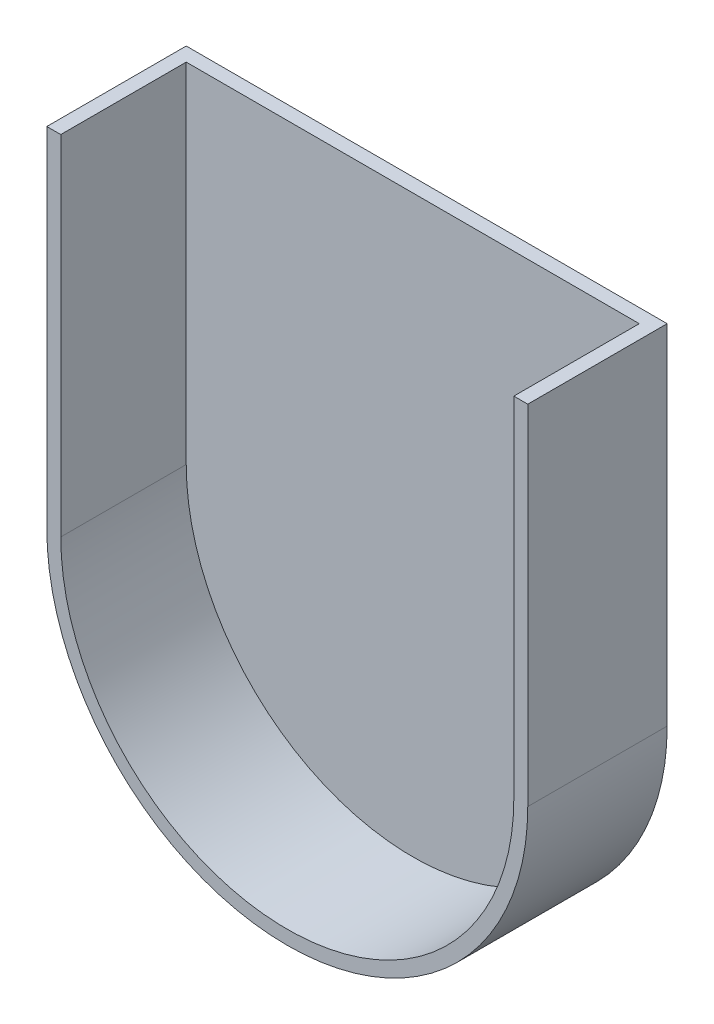
ISO-10303-21;
HEADER;
FILE_DESCRIPTION(('STEP AP214'),'2;1');
FILE_NAME('part.step','',(''),(''),'','','');
FILE_SCHEMA(('AUTOMOTIVE_DESIGN { 1 0 10303 214 1 1 1 1 }'));
ENDSEC;
DATA;
#1=APPLICATION_CONTEXT('core data for automotive mechanical design processes');
#2=APPLICATION_PROTOCOL_DEFINITION('international standard','automotive_design',2000,#1);
#3=PRODUCT_CONTEXT('',#1,'mechanical');
#4=PRODUCT('Part','Part','',(#3));
#5=PRODUCT_RELATED_PRODUCT_CATEGORY('part','',(#4));
#6=PRODUCT_DEFINITION_FORMATION('','',#4);
#7=PRODUCT_DEFINITION_CONTEXT('part definition',#1,'design');
#8=PRODUCT_DEFINITION('design','',#6,#7);
#9=PRODUCT_DEFINITION_SHAPE('','',#8);
#10=(LENGTH_UNIT() NAMED_UNIT(*) SI_UNIT(.MILLI.,.METRE.));
#11=(NAMED_UNIT(*) PLANE_ANGLE_UNIT() SI_UNIT($,.RADIAN.));
#12=(NAMED_UNIT(*) SI_UNIT($,.STERADIAN.) SOLID_ANGLE_UNIT());
#13=UNCERTAINTY_MEASURE_WITH_UNIT(LENGTH_MEASURE(1.E-05),#10,'distance_accuracy_value','');
#14=(GEOMETRIC_REPRESENTATION_CONTEXT(3) GLOBAL_UNCERTAINTY_ASSIGNED_CONTEXT((#13)) GLOBAL_UNIT_ASSIGNED_CONTEXT((#10,
#11,#12)) REPRESENTATION_CONTEXT('',''));
#15=CARTESIAN_POINT('',(0.,0.,0.));
#16=DIRECTION('',(0.,0.,1.));
#17=DIRECTION('',(1.,0.,0.));
#18=AXIS2_PLACEMENT_3D('',#15,#16,#17);
#19=CARTESIAN_POINT('',(-34.5,0.,20.));
#20=DIRECTION('',(-1.,0.,0.));
#21=DIRECTION('',(0.,0.,1.));
#22=AXIS2_PLACEMENT_3D('',#19,#20,#21);
#23=PLANE('',#22);
#24=DIRECTION('',(0.,1.,0.));
#25=VECTOR('',#24,1.);
#26=CARTESIAN_POINT('',(-34.5,0.,0.));
#27=LINE('',#26,#25);
#28=CARTESIAN_POINT('',(-34.5,0.,0.));
#29=VERTEX_POINT('',#28);
#30=CARTESIAN_POINT('',(-34.5,50.,0.));
#31=VERTEX_POINT('',#30);
#32=EDGE_CURVE('E129',#29,#31,#27,.T.);
#33=ORIENTED_EDGE('',*,*,#32,.F.);
#34=DIRECTION('',(0.,0.,-1.));
#35=VECTOR('',#34,1.);
#36=CARTESIAN_POINT('',(-34.5,0.,20.));
#37=LINE('',#36,#35);
#38=CARTESIAN_POINT('',(-34.5,0.,20.));
#39=VERTEX_POINT('',#38);
#40=EDGE_CURVE('E11',#39,#29,#37,.T.);
#41=ORIENTED_EDGE('',*,*,#40,.F.);
#42=DIRECTION('',(0.,1.,0.));
#43=VECTOR('',#42,1.);
#44=CARTESIAN_POINT('',(-34.5,0.,20.));
#45=LINE('',#44,#43);
#46=CARTESIAN_POINT('',(-34.5,50.,20.));
#47=VERTEX_POINT('',#46);
#48=EDGE_CURVE('E138',#39,#47,#45,.T.);
#49=ORIENTED_EDGE('',*,*,#48,.T.);
#50=DIRECTION('',(0.,0.,-1.));
#51=VECTOR('',#50,1.);
#52=CARTESIAN_POINT('',(-34.5,50.,20.));
#53=LINE('',#52,#51);
#54=EDGE_CURVE('E52',#47,#31,#53,.T.);
#55=ORIENTED_EDGE('',*,*,#54,.T.);
#56=EDGE_LOOP('',(#33,#41,#49,#55));
#57=FACE_BOUND('',#56,.T.);
#58=ADVANCED_FACE('F36',(#57),#23,.T.);
#59=CARTESIAN_POINT('',(0.,0.,20.));
#60=DIRECTION('',(0.,0.,-1.));
#61=DIRECTION('',(-1.,0.,0.));
#62=AXIS2_PLACEMENT_3D('',#59,#60,#61);
#63=CYLINDRICAL_SURFACE('',#62,34.5);
#64=CARTESIAN_POINT('',(0.,0.,0.));
#65=DIRECTION('',(0.,0.,1.));
#66=DIRECTION('',(1.,0.,0.));
#67=AXIS2_PLACEMENT_3D('',#64,#65,#66);
#68=CIRCLE('',#67,34.5);
#69=CARTESIAN_POINT('',(34.5,0.,0.));
#70=VERTEX_POINT('',#69);
#71=EDGE_CURVE('E131',#29,#70,#68,.T.);
#72=ORIENTED_EDGE('',*,*,#71,.T.);
#73=DIRECTION('',(0.,0.,-1.));
#74=VECTOR('',#73,1.);
#75=CARTESIAN_POINT('',(34.5,0.,20.));
#76=LINE('',#75,#74);
#77=CARTESIAN_POINT('',(34.5,0.,20.));
#78=VERTEX_POINT('',#77);
#79=EDGE_CURVE('E44',#78,#70,#76,.T.);
#80=ORIENTED_EDGE('',*,*,#79,.F.);
#81=CARTESIAN_POINT('',(0.,0.,20.));
#82=DIRECTION('',(0.,0.,1.));
#83=DIRECTION('',(1.,0.,0.));
#84=AXIS2_PLACEMENT_3D('',#81,#82,#83);
#85=CIRCLE('',#84,34.5);
#86=EDGE_CURVE('E201',#39,#78,#85,.T.);
#87=ORIENTED_EDGE('',*,*,#86,.F.);
#88=ORIENTED_EDGE('',*,*,#40,.T.);
#89=EDGE_LOOP('',(#72,#80,#87,#88));
#90=FACE_BOUND('',#89,.T.);
#91=ADVANCED_FACE('F157',(#90),#63,.T.);
#92=CARTESIAN_POINT('',(34.5,0.,20.));
#93=DIRECTION('',(-1.,0.,0.));
#94=DIRECTION('',(0.,0.,1.));
#95=AXIS2_PLACEMENT_3D('',#92,#93,#94);
#96=PLANE('',#95);
#97=DIRECTION('',(0.,1.,0.));
#98=VECTOR('',#97,1.);
#99=CARTESIAN_POINT('',(34.5,0.,0.));
#100=LINE('',#99,#98);
#101=CARTESIAN_POINT('',(34.5,50.,0.));
#102=VERTEX_POINT('',#101);
#103=EDGE_CURVE('E134',#70,#102,#100,.T.);
#104=ORIENTED_EDGE('',*,*,#103,.T.);
#105=DIRECTION('',(0.,0.,-1.));
#106=VECTOR('',#105,1.);
#107=CARTESIAN_POINT('',(34.5,50.,20.));
#108=LINE('',#107,#106);
#109=CARTESIAN_POINT('',(34.5,50.,20.));
#110=VERTEX_POINT('',#109);
#111=EDGE_CURVE('E145',#110,#102,#108,.T.);
#112=ORIENTED_EDGE('',*,*,#111,.F.);
#113=DIRECTION('',(0.,1.,0.));
#114=VECTOR('',#113,1.);
#115=CARTESIAN_POINT('',(34.5,0.,20.));
#116=LINE('',#115,#114);
#117=EDGE_CURVE('E152',#78,#110,#116,.T.);
#118=ORIENTED_EDGE('',*,*,#117,.F.);
#119=ORIENTED_EDGE('',*,*,#79,.T.);
#120=EDGE_LOOP('',(#104,#112,#118,#119));
#121=FACE_BOUND('',#120,.T.);
#122=ADVANCED_FACE('F150',(#121),#96,.F.);
#123=CARTESIAN_POINT('',(32.5,0.,20.));
#124=DIRECTION('',(-1.,0.,0.));
#125=DIRECTION('',(0.,0.,1.));
#126=AXIS2_PLACEMENT_3D('',#123,#124,#125);
#127=PLANE('',#126);
#128=DIRECTION('',(0.,1.,0.));
#129=VECTOR('',#128,1.);
#130=CARTESIAN_POINT('',(32.5,0.,2.));
#131=LINE('',#130,#129);
#132=CARTESIAN_POINT('',(32.5,0.,2.));
#133=VERTEX_POINT('',#132);
#134=CARTESIAN_POINT('',(32.5,50.,2.));
#135=VERTEX_POINT('',#134);
#136=EDGE_CURVE('E195',#133,#135,#131,.T.);
#137=ORIENTED_EDGE('',*,*,#136,.F.);
#138=DIRECTION('',(0.,0.,-1.));
#139=VECTOR('',#138,1.);
#140=CARTESIAN_POINT('',(32.5,0.,20.));
#141=LINE('',#140,#139);
#142=CARTESIAN_POINT('',(32.5,0.,20.));
#143=VERTEX_POINT('',#142);
#144=EDGE_CURVE('E107',#143,#133,#141,.T.);
#145=ORIENTED_EDGE('',*,*,#144,.F.);
#146=DIRECTION('',(0.,1.,0.));
#147=VECTOR('',#146,1.);
#148=CARTESIAN_POINT('',(32.5,0.,20.));
#149=LINE('',#148,#147);
#150=CARTESIAN_POINT('',(32.5,50.,20.));
#151=VERTEX_POINT('',#150);
#152=EDGE_CURVE('E123',#143,#151,#149,.T.);
#153=ORIENTED_EDGE('',*,*,#152,.T.);
#154=DIRECTION('',(0.,0.,-1.));
#155=VECTOR('',#154,1.);
#156=CARTESIAN_POINT('',(32.5,50.,20.));
#157=LINE('',#156,#155);
#158=EDGE_CURVE('E142',#151,#135,#157,.T.);
#159=ORIENTED_EDGE('',*,*,#158,.T.);
#160=EDGE_LOOP('',(#137,#145,#153,#159));
#161=FACE_BOUND('',#160,.T.);
#162=ADVANCED_FACE('F164',(#161),#127,.T.);
#163=CARTESIAN_POINT('',(0.,0.,20.));
#164=DIRECTION('',(0.,0.,-1.));
#165=DIRECTION('',(-1.,0.,0.));
#166=AXIS2_PLACEMENT_3D('',#163,#164,#165);
#167=CYLINDRICAL_SURFACE('',#166,32.5);
#168=CARTESIAN_POINT('',(0.,0.,2.));
#169=DIRECTION('',(0.,0.,1.));
#170=DIRECTION('',(1.,0.,0.));
#171=AXIS2_PLACEMENT_3D('',#168,#169,#170);
#172=CIRCLE('',#171,32.5);
#173=CARTESIAN_POINT('',(-32.5,0.,2.));
#174=VERTEX_POINT('',#173);
#175=EDGE_CURVE('E104',#174,#133,#172,.T.);
#176=ORIENTED_EDGE('',*,*,#175,.F.);
#177=DIRECTION('',(0.,0.,-1.));
#178=VECTOR('',#177,1.);
#179=CARTESIAN_POINT('',(-32.5,0.,20.));
#180=LINE('',#179,#178);
#181=CARTESIAN_POINT('',(-32.5,0.,20.));
#182=VERTEX_POINT('',#181);
#183=EDGE_CURVE('E96',#182,#174,#180,.T.);
#184=ORIENTED_EDGE('',*,*,#183,.F.);
#185=CARTESIAN_POINT('',(0.,0.,20.));
#186=DIRECTION('',(0.,0.,1.));
#187=DIRECTION('',(1.,0.,0.));
#188=AXIS2_PLACEMENT_3D('',#185,#186,#187);
#189=CIRCLE('',#188,32.5);
#190=EDGE_CURVE('E101',#182,#143,#189,.T.);
#191=ORIENTED_EDGE('',*,*,#190,.T.);
#192=ORIENTED_EDGE('',*,*,#144,.T.);
#193=EDGE_LOOP('',(#176,#184,#191,#192));
#194=FACE_BOUND('',#193,.T.);
#195=ADVANCED_FACE('F98',(#194),#167,.F.);
#196=CARTESIAN_POINT('',(-32.5,0.,20.));
#197=DIRECTION('',(-1.,0.,0.));
#198=DIRECTION('',(0.,0.,1.));
#199=AXIS2_PLACEMENT_3D('',#196,#197,#198);
#200=PLANE('',#199);
#201=ORIENTED_EDGE('',*,*,#183,.T.);
#202=DIRECTION('',(0.,1.,0.));
#203=VECTOR('',#202,1.);
#204=CARTESIAN_POINT('',(-32.5,0.,2.));
#205=LINE('',#204,#203);
#206=CARTESIAN_POINT('',(-32.5,50.,2.));
#207=VERTEX_POINT('',#206);
#208=EDGE_CURVE('E188',#174,#207,#205,.T.);
#209=ORIENTED_EDGE('',*,*,#208,.T.);
#210=DIRECTION('',(0.,0.,-1.));
#211=VECTOR('',#210,1.);
#212=CARTESIAN_POINT('',(-32.5,50.,20.));
#213=LINE('',#212,#211);
#214=CARTESIAN_POINT('',(-32.5,50.,20.));
#215=VERTEX_POINT('',#214);
#216=EDGE_CURVE('E108',#215,#207,#213,.T.);
#217=ORIENTED_EDGE('',*,*,#216,.F.);
#218=DIRECTION('',(0.,1.,0.));
#219=VECTOR('',#218,1.);
#220=CARTESIAN_POINT('',(-32.5,0.,20.));
#221=LINE('',#220,#219);
#222=EDGE_CURVE('E111',#182,#215,#221,.T.);
#223=ORIENTED_EDGE('',*,*,#222,.F.);
#224=EDGE_LOOP('',(#201,#209,#217,#223));
#225=FACE_BOUND('',#224,.T.);
#226=ADVANCED_FACE('F112',(#225),#200,.F.);
#227=CARTESIAN_POINT('',(0.,50.,20.));
#228=DIRECTION('',(0.,1.,0.));
#229=DIRECTION('',(-1.,0.,0.));
#230=AXIS2_PLACEMENT_3D('',#227,#228,#229);
#231=PLANE('',#230);
#232=DIRECTION('',(1.,0.,0.));
#233=VECTOR('',#232,1.);
#234=CARTESIAN_POINT('',(0.,50.,0.));
#235=LINE('',#234,#233);
#236=EDGE_CURVE('E69',#31,#102,#235,.T.);
#237=ORIENTED_EDGE('',*,*,#236,.F.);
#238=ORIENTED_EDGE('',*,*,#54,.F.);
#239=DIRECTION('',(1.,0.,0.));
#240=VECTOR('',#239,1.);
#241=CARTESIAN_POINT('',(0.,50.,20.));
#242=LINE('',#241,#240);
#243=EDGE_CURVE('E116',#47,#215,#242,.T.);
#244=ORIENTED_EDGE('',*,*,#243,.T.);
#245=ORIENTED_EDGE('',*,*,#216,.T.);
#246=DIRECTION('',(-1.,0.,0.));
#247=VECTOR('',#246,1.);
#248=CARTESIAN_POINT('',(0.,50.,2.));
#249=LINE('',#248,#247);
#250=EDGE_CURVE('E132',#135,#207,#249,.T.);
#251=ORIENTED_EDGE('',*,*,#250,.F.);
#252=ORIENTED_EDGE('',*,*,#158,.F.);
#253=EDGE_CURVE('E125',#151,#110,#242,.T.);
#254=ORIENTED_EDGE('',*,*,#253,.T.);
#255=ORIENTED_EDGE('',*,*,#111,.T.);
#256=EDGE_LOOP('',(#237,#238,#244,#245,#251,#252,#254,#255));
#257=FACE_BOUND('',#256,.T.);
#258=ADVANCED_FACE('F174',(#257),#231,.T.);
#259=CARTESIAN_POINT('',(0.,0.,20.));
#260=DIRECTION('',(0.,0.,1.));
#261=DIRECTION('',(1.,0.,0.));
#262=AXIS2_PLACEMENT_3D('',#259,#260,#261);
#263=PLANE('',#262);
#264=ORIENTED_EDGE('',*,*,#48,.F.);
#265=ORIENTED_EDGE('',*,*,#86,.T.);
#266=ORIENTED_EDGE('',*,*,#117,.T.);
#267=ORIENTED_EDGE('',*,*,#253,.F.);
#268=ORIENTED_EDGE('',*,*,#152,.F.);
#269=ORIENTED_EDGE('',*,*,#190,.F.);
#270=ORIENTED_EDGE('',*,*,#222,.T.);
#271=ORIENTED_EDGE('',*,*,#243,.F.);
#272=EDGE_LOOP('',(#264,#265,#266,#267,#268,#269,#270,#271));
#273=FACE_BOUND('',#272,.T.);
#274=ADVANCED_FACE('F120',(#273),#263,.T.);
#275=CARTESIAN_POINT('',(0.,0.,0.));
#276=DIRECTION('',(0.,0.,1.));
#277=DIRECTION('',(1.,0.,0.));
#278=AXIS2_PLACEMENT_3D('',#275,#276,#277);
#279=PLANE('',#278);
#280=ORIENTED_EDGE('',*,*,#236,.T.);
#281=ORIENTED_EDGE('',*,*,#103,.F.);
#282=ORIENTED_EDGE('',*,*,#71,.F.);
#283=ORIENTED_EDGE('',*,*,#32,.T.);
#284=EDGE_LOOP('',(#280,#281,#282,#283));
#285=FACE_BOUND('',#284,.T.);
#286=ADVANCED_FACE('F155',(#285),#279,.F.);
#287=CARTESIAN_POINT('',(0.,0.,2.));
#288=DIRECTION('',(0.,0.,1.));
#289=DIRECTION('',(1.,0.,0.));
#290=AXIS2_PLACEMENT_3D('',#287,#288,#289);
#291=PLANE('',#290);
#292=ORIENTED_EDGE('',*,*,#208,.F.);
#293=ORIENTED_EDGE('',*,*,#175,.T.);
#294=ORIENTED_EDGE('',*,*,#136,.T.);
#295=ORIENTED_EDGE('',*,*,#250,.T.);
#296=EDGE_LOOP('',(#292,#293,#294,#295));
#297=FACE_BOUND('',#296,.T.);
#298=ADVANCED_FACE('F179',(#297),#291,.T.);
#299=CLOSED_SHELL('',(#58,#91,#122,#162,#195,#226,#258,#274,#286,#298));
#300=MANIFOLD_SOLID_BREP('B2',#299);
#301=ADVANCED_BREP_SHAPE_REPRESENTATION('',(#18,#300),#14);
#302=SHAPE_DEFINITION_REPRESENTATION(#9,#301);
ENDSEC;
END-ISO-10303-21;
